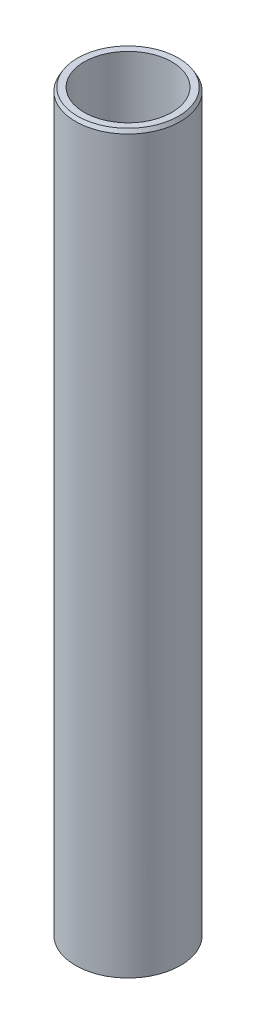
ISO-10303-21;
HEADER;
FILE_DESCRIPTION(('STEP AP214'),'2;1');
FILE_NAME('part.step','',(''),(''),'','','');
FILE_SCHEMA(('AUTOMOTIVE_DESIGN { 1 0 10303 214 1 1 1 1 }'));
ENDSEC;
DATA;
#1=APPLICATION_CONTEXT('core data for automotive mechanical design processes');
#2=APPLICATION_PROTOCOL_DEFINITION('international standard','automotive_design',2000,#1);
#3=PRODUCT_CONTEXT('',#1,'mechanical');
#4=PRODUCT('Part','Part','',(#3));
#5=PRODUCT_RELATED_PRODUCT_CATEGORY('part','',(#4));
#6=PRODUCT_DEFINITION_FORMATION('','',#4);
#7=PRODUCT_DEFINITION_CONTEXT('part definition',#1,'design');
#8=PRODUCT_DEFINITION('design','',#6,#7);
#9=PRODUCT_DEFINITION_SHAPE('','',#8);
#10=(LENGTH_UNIT() NAMED_UNIT(*) SI_UNIT(.MILLI.,.METRE.));
#11=(NAMED_UNIT(*) PLANE_ANGLE_UNIT() SI_UNIT($,.RADIAN.));
#12=(NAMED_UNIT(*) SI_UNIT($,.STERADIAN.) SOLID_ANGLE_UNIT());
#13=UNCERTAINTY_MEASURE_WITH_UNIT(LENGTH_MEASURE(1.E-05),#10,'distance_accuracy_value','');
#14=(GEOMETRIC_REPRESENTATION_CONTEXT(3) GLOBAL_UNCERTAINTY_ASSIGNED_CONTEXT((#13)) GLOBAL_UNIT_ASSIGNED_CONTEXT((#10,
#11,#12)) REPRESENTATION_CONTEXT('',''));
#15=CARTESIAN_POINT('',(0.,0.,0.));
#16=DIRECTION('',(0.,0.,1.));
#17=DIRECTION('',(1.,0.,0.));
#18=AXIS2_PLACEMENT_3D('',#15,#16,#17);
#19=CARTESIAN_POINT('',(0.,526.183527957873,0.));
#20=DIRECTION('',(0.,-1.,0.));
#21=DIRECTION('',(0.,0.,-1.));
#22=AXIS2_PLACEMENT_3D('',#19,#20,#21);
#23=CYLINDRICAL_SURFACE('',#22,37.5);
#24=CARTESIAN_POINT('',(0.,523.640362782101,0.));
#25=DIRECTION('',(0.,1.,0.));
#26=DIRECTION('',(0.,0.,1.));
#27=AXIS2_PLACEMENT_3D('',#24,#25,#26);
#28=CIRCLE('',#27,37.5);
#29=CARTESIAN_POINT('',(0.,523.640362782101,-37.5));
#30=VERTEX_POINT('',#29);
#31=EDGE_CURVE('E50',#30,#30,#28,.F.);
#32=CARTESIAN_POINT('',(0.,1.46829709882645,0.));
#33=DIRECTION('',(0.,1.,0.));
#34=DIRECTION('',(0.,0.,1.));
#35=AXIS2_PLACEMENT_3D('',#32,#33,#34);
#36=CIRCLE('',#35,37.5);
#37=CARTESIAN_POINT('',(0.,1.46829709882645,-37.5));
#38=VERTEX_POINT('',#37);
#39=EDGE_CURVE('E51',#38,#38,#36,.T.);
#40=CARTESIAN_POINT('',(0.,523.640362782101,-37.5));
#41=CARTESIAN_POINT('',(0.,518.201070431233,-37.5));
#42=CARTESIAN_POINT('',(0.,512.761778080366,-37.5));
#43=CARTESIAN_POINT('',(0.,501.883193378631,-37.5));
#44=CARTESIAN_POINT('',(0.,496.443901027763,-37.5));
#45=CARTESIAN_POINT('',(0.,485.565316326029,-37.5));
#46=CARTESIAN_POINT('',(0.,480.126023975161,-37.5));
#47=CARTESIAN_POINT('',(0.,469.247439273426,-37.5));
#48=CARTESIAN_POINT('',(0.,463.808146922559,-37.5));
#49=CARTESIAN_POINT('',(0.,452.929562220824,-37.5));
#50=CARTESIAN_POINT('',(0.,447.490269869956,-37.5));
#51=CARTESIAN_POINT('',(0.,436.611685168222,-37.5));
#52=CARTESIAN_POINT('',(0.,431.172392817354,-37.5));
#53=CARTESIAN_POINT('',(0.,420.293808115619,-37.5));
#54=CARTESIAN_POINT('',(0.,414.854515764752,-37.5));
#55=CARTESIAN_POINT('',(0.,403.975931063017,-37.5));
#56=CARTESIAN_POINT('',(0.,398.53663871215,-37.5));
#57=CARTESIAN_POINT('',(0.,387.658054010415,-37.5));
#58=CARTESIAN_POINT('',(0.,382.218761659547,-37.5));
#59=CARTESIAN_POINT('',(0.,371.340176957812,-37.5));
#60=CARTESIAN_POINT('',(0.,365.900884606945,-37.5));
#61=CARTESIAN_POINT('',(0.,355.02229990521,-37.5));
#62=CARTESIAN_POINT('',(0.,349.583007554343,-37.5));
#63=CARTESIAN_POINT('',(0.,338.704422852608,-37.5));
#64=CARTESIAN_POINT('',(0.,333.26513050174,-37.5));
#65=CARTESIAN_POINT('',(0.,322.386545800005,-37.5));
#66=CARTESIAN_POINT('',(0.,316.947253449138,-37.5));
#67=CARTESIAN_POINT('',(0.,306.068668747403,-37.5));
#68=CARTESIAN_POINT('',(0.,300.629376396536,-37.5));
#69=CARTESIAN_POINT('',(0.,289.750791694801,-37.5));
#70=CARTESIAN_POINT('',(0.,284.311499343933,-37.5));
#71=CARTESIAN_POINT('',(0.,273.432914642198,-37.5));
#72=CARTESIAN_POINT('',(0.,267.993622291331,-37.5));
#73=CARTESIAN_POINT('',(0.,257.115037589596,-37.5));
#74=CARTESIAN_POINT('',(0.,251.675745238729,-37.5));
#75=CARTESIAN_POINT('',(0.,240.797160536994,-37.5));
#76=CARTESIAN_POINT('',(0.,235.357868186126,-37.5));
#77=CARTESIAN_POINT('',(0.,224.479283484391,-37.5));
#78=CARTESIAN_POINT('',(0.,219.039991133524,-37.5));
#79=CARTESIAN_POINT('',(0.,208.161406431789,-37.5));
#80=CARTESIAN_POINT('',(0.,202.722114080922,-37.5));
#81=CARTESIAN_POINT('',(0.,191.843529379187,-37.5));
#82=CARTESIAN_POINT('',(0.,186.404237028319,-37.5));
#83=CARTESIAN_POINT('',(0.,175.525652326585,-37.5));
#84=CARTESIAN_POINT('',(0.,170.086359975717,-37.5));
#85=CARTESIAN_POINT('',(0.,159.207775273982,-37.5));
#86=CARTESIAN_POINT('',(0.,153.768482923115,-37.5));
#87=CARTESIAN_POINT('',(0.,142.88989822138,-37.5));
#88=CARTESIAN_POINT('',(0.,137.450605870512,-37.5));
#89=CARTESIAN_POINT('',(0.,126.572021168778,-37.5));
#90=CARTESIAN_POINT('',(0.,121.13272881791,-37.5));
#91=CARTESIAN_POINT('',(0.,110.254144116175,-37.5));
#92=CARTESIAN_POINT('',(0.,104.814851765308,-37.5));
#93=CARTESIAN_POINT('',(0.,93.9362670635729,-37.5));
#94=CARTESIAN_POINT('',(0.,88.4969747127055,-37.5));
#95=CARTESIAN_POINT('',(0.,77.6183900109706,-37.5));
#96=CARTESIAN_POINT('',(0.,72.1790976601032,-37.5));
#97=CARTESIAN_POINT('',(0.,61.3005129583683,-37.5));
#98=CARTESIAN_POINT('',(0.,55.8612206075008,-37.5));
#99=CARTESIAN_POINT('',(0.,44.982635905766,-37.5));
#100=CARTESIAN_POINT('',(0.,39.5433435548985,-37.5));
#101=CARTESIAN_POINT('',(0.,28.6647588531637,-37.5));
#102=CARTESIAN_POINT('',(0.,23.2254665022962,-37.5));
#103=CARTESIAN_POINT('',(0.,12.3468818005614,-37.5));
#104=CARTESIAN_POINT('',(0.,6.90758944969391,-37.5));
#105=CARTESIAN_POINT('',(0.,1.46829709882645,-37.5));
#106=B_SPLINE_CURVE_WITH_KNOTS('',3,(#40,#41,#42,#43,#44,#45,#46,#47,#48,#49,#50,#51,#52,#53,
#54,#55,#56,#57,#58,#59,#60,#61,#62,#63,#64,#65,#66,#67,#68,#69,#70,#71,#72,#73,#74,#75,#76,#77,
#78,#79,#80,#81,#82,#83,#84,#85,#86,#87,#88,#89,#90,#91,#92,#93,#94,#95,#96,#97,#98,#99,#100,
#101,#102,#103,#104,#105),.UNSPECIFIED.,.F.,.F.,(4,2,2,2,2,2,2,2,2,2,2,2,2,2,2,2,2,2,2,2,2,2,2,
2,2,2,2,2,2,2,2,2,4),(0.,16.3178770526022,32.6357541052046,48.9536311578069,65.2715082104092,
81.5893852630115,97.9072623156139,114.225139368216,130.543016420818,146.860893473421,
163.178770526023,179.496647578625,195.814524631228,212.13240168383,228.450278736432,
244.768155789035,261.086032841637,277.403909894239,293.721786946842,310.039663999444,
326.357541052046,342.675418104649,358.993295157251,375.311172209853,391.629049262456,
407.946926315058,424.26480336766,440.582680420262,456.900557472865,473.218434525467,
489.53631157807,505.854188630672,522.172065683274),.UNSPECIFIED.);
#107=EDGE_CURVE('BSEAM39',#30,#38,#106,.T.);
#108=ORIENTED_EDGE('',*,*,#31,.T.);
#109=ORIENTED_EDGE('',*,*,#39,.T.);
#110=ORIENTED_EDGE('',*,*,#107,.T.);
#111=ORIENTED_EDGE('',*,*,#107,.F.);
#112=EDGE_LOOP('',(#108,#110,#109,#111));
#113=FACE_BOUND('',#112,.T.);
#114=ADVANCED_FACE('F39',(#113),#23,.T.);
#115=CARTESIAN_POINT('',(0.,526.183527957873,0.));
#116=DIRECTION('',(0.,1.,0.));
#117=DIRECTION('',(0.,0.,1.));
#118=AXIS2_PLACEMENT_3D('',#115,#116,#117);
#119=PLANE('',#118);
#120=CARTESIAN_POINT('',(0.,526.183527957873,0.));
#121=DIRECTION('',(0.,1.,0.));
#122=DIRECTION('',(0.,0.,1.));
#123=AXIS2_PLACEMENT_3D('',#120,#121,#122);
#124=CIRCLE('',#123,36.031702901174);
#125=CARTESIAN_POINT('',(0.,526.183527957873,36.031702901174));
#126=VERTEX_POINT('',#125);
#127=EDGE_CURVE('E54',#126,#126,#124,.T.);
#128=ORIENTED_EDGE('',*,*,#127,.T.);
#129=EDGE_LOOP('',(#128));
#130=FACE_BOUND('',#129,.T.);
#131=CARTESIAN_POINT('',(0.,526.183527957873,0.));
#132=DIRECTION('',(0.,1.,0.));
#133=DIRECTION('',(0.,0.,1.));
#134=AXIS2_PLACEMENT_3D('',#131,#132,#133);
#135=CIRCLE('',#134,31.3051845331826);
#136=CARTESIAN_POINT('',(0.,526.183527957873,-31.3051845331826));
#137=VERTEX_POINT('',#136);
#138=EDGE_CURVE('E58',#137,#137,#135,.T.);
#139=ORIENTED_EDGE('',*,*,#138,.F.);
#140=EDGE_LOOP('',(#139));
#141=FACE_BOUND('',#140,.T.);
#142=ADVANCED_FACE('F69',(#130,#141),#119,.T.);
#143=CARTESIAN_POINT('',(0.,0.,0.));
#144=DIRECTION('',(0.,1.,0.));
#145=DIRECTION('',(0.,0.,1.));
#146=AXIS2_PLACEMENT_3D('',#143,#144,#145);
#147=PLANE('',#146);
#148=CARTESIAN_POINT('',(0.,0.,0.));
#149=DIRECTION('',(0.,1.,0.));
#150=DIRECTION('',(0.,0.,1.));
#151=AXIS2_PLACEMENT_3D('',#148,#149,#150);
#152=CIRCLE('',#151,34.9568348242266);
#153=CARTESIAN_POINT('',(0.,0.,34.9568348242266));
#154=VERTEX_POINT('',#153);
#155=EDGE_CURVE('E10',#154,#154,#152,.F.);
#156=ORIENTED_EDGE('',*,*,#155,.T.);
#157=EDGE_LOOP('',(#156));
#158=FACE_BOUND('',#157,.T.);
#159=CARTESIAN_POINT('',(0.,0.,0.));
#160=DIRECTION('',(0.,1.,0.));
#161=DIRECTION('',(0.,0.,1.));
#162=AXIS2_PLACEMENT_3D('',#159,#160,#161);
#163=CIRCLE('',#162,31.3051845331826);
#164=CARTESIAN_POINT('',(0.,0.,-31.3051845331826));
#165=VERTEX_POINT('',#164);
#166=EDGE_CURVE('E63',#165,#165,#163,.T.);
#167=ORIENTED_EDGE('',*,*,#166,.T.);
#168=EDGE_LOOP('',(#167));
#169=FACE_BOUND('',#168,.T.);
#170=ADVANCED_FACE('F75',(#158,#169),#147,.F.);
#171=CARTESIAN_POINT('',(0.,526.183527957873,0.));
#172=DIRECTION('',(0.,-1.,0.));
#173=DIRECTION('',(0.,0.,-1.));
#174=AXIS2_PLACEMENT_3D('',#171,#172,#173);
#175=CYLINDRICAL_SURFACE('',#174,31.3051845331826);
#176=CARTESIAN_POINT('',(0.,526.183527957873,-31.3051845331826));
#177=CARTESIAN_POINT('',(0.,520.702449541645,-31.3051845331826));
#178=CARTESIAN_POINT('',(0.,515.221371125418,-31.3051845331826));
#179=CARTESIAN_POINT('',(0.,504.259214292962,-31.3051845331826));
#180=CARTESIAN_POINT('',(0.,498.778135876734,-31.3051845331826));
#181=CARTESIAN_POINT('',(0.,487.815979044278,-31.3051845331826));
#182=CARTESIAN_POINT('',(0.,482.334900628051,-31.3051845331826));
#183=CARTESIAN_POINT('',(0.,471.372743795595,-31.3051845331826));
#184=CARTESIAN_POINT('',(0.,465.891665379367,-31.3051845331826));
#185=CARTESIAN_POINT('',(0.,454.929508546911,-31.3051845331826));
#186=CARTESIAN_POINT('',(0.,449.448430130683,-31.3051845331826));
#187=CARTESIAN_POINT('',(0.,438.486273298228,-31.3051845331826));
#188=CARTESIAN_POINT('',(0.,433.005194882,-31.3051845331826));
#189=CARTESIAN_POINT('',(0.,422.043038049544,-31.3051845331826));
#190=CARTESIAN_POINT('',(0.,416.561959633316,-31.3051845331826));
#191=CARTESIAN_POINT('',(0.,405.599802800861,-31.3051845331826));
#192=CARTESIAN_POINT('',(0.,400.118724384633,-31.3051845331826));
#193=CARTESIAN_POINT('',(0.,389.156567552177,-31.3051845331826));
#194=CARTESIAN_POINT('',(0.,383.675489135949,-31.3051845331826));
#195=CARTESIAN_POINT('',(0.,372.713332303494,-31.3051845331826));
#196=CARTESIAN_POINT('',(0.,367.232253887266,-31.3051845331826));
#197=CARTESIAN_POINT('',(0.,356.27009705481,-31.3051845331826));
#198=CARTESIAN_POINT('',(0.,350.789018638582,-31.3051845331826));
#199=CARTESIAN_POINT('',(0.,339.826861806126,-31.3051845331826));
#200=CARTESIAN_POINT('',(0.,334.345783389899,-31.3051845331826));
#201=CARTESIAN_POINT('',(0.,323.383626557443,-31.3051845331826));
#202=CARTESIAN_POINT('',(0.,317.902548141215,-31.3051845331826));
#203=CARTESIAN_POINT('',(0.,306.940391308759,-31.3051845331826));
#204=CARTESIAN_POINT('',(0.,301.459312892532,-31.3051845331826));
#205=CARTESIAN_POINT('',(0.,290.497156060076,-31.3051845331826));
#206=CARTESIAN_POINT('',(0.,285.016077643848,-31.3051845331826));
#207=CARTESIAN_POINT('',(0.,274.053920811392,-31.3051845331826));
#208=CARTESIAN_POINT('',(0.,268.572842395165,-31.3051845331826));
#209=CARTESIAN_POINT('',(0.,257.610685562709,-31.3051845331826));
#210=CARTESIAN_POINT('',(0.,252.129607146481,-31.3051845331826));
#211=CARTESIAN_POINT('',(0.,241.167450314025,-31.3051845331826));
#212=CARTESIAN_POINT('',(0.,235.686371897797,-31.3051845331826));
#213=CARTESIAN_POINT('',(0.,224.724215065342,-31.3051845331826));
#214=CARTESIAN_POINT('',(0.,219.243136649114,-31.3051845331826));
#215=CARTESIAN_POINT('',(0.,208.280979816658,-31.3051845331826));
#216=CARTESIAN_POINT('',(0.,202.79990140043,-31.3051845331826));
#217=CARTESIAN_POINT('',(0.,191.837744567975,-31.3051845331826));
#218=CARTESIAN_POINT('',(0.,186.356666151747,-31.3051845331826));
#219=CARTESIAN_POINT('',(0.,175.394509319291,-31.3051845331826));
#220=CARTESIAN_POINT('',(0.,169.913430903063,-31.3051845331826));
#221=CARTESIAN_POINT('',(0.,158.951274070608,-31.3051845331826));
#222=CARTESIAN_POINT('',(0.,153.47019565438,-31.3051845331826));
#223=CARTESIAN_POINT('',(0.,142.508038821924,-31.3051845331826));
#224=CARTESIAN_POINT('',(0.,137.026960405696,-31.3051845331826));
#225=CARTESIAN_POINT('',(0.,126.064803573241,-31.3051845331826));
#226=CARTESIAN_POINT('',(0.,120.583725157013,-31.3051845331826));
#227=CARTESIAN_POINT('',(0.,109.621568324557,-31.3051845331826));
#228=CARTESIAN_POINT('',(0.,104.140489908329,-31.3051845331826));
#229=CARTESIAN_POINT('',(0.,93.1783330758734,-31.3051845331826));
#230=CARTESIAN_POINT('',(0.,87.6972546596456,-31.3051845331826));
#231=CARTESIAN_POINT('',(0.,76.7350978271899,-31.3051845331826));
#232=CARTESIAN_POINT('',(0.,71.254019410962,-31.3051845331826));
#233=CARTESIAN_POINT('',(0.,60.2918625785063,-31.3051845331826));
#234=CARTESIAN_POINT('',(0.,54.8107841622785,-31.3051845331826));
#235=CARTESIAN_POINT('',(0.,43.8486273298228,-31.3051845331826));
#236=CARTESIAN_POINT('',(0.,38.3675489135949,-31.3051845331826));
#237=CARTESIAN_POINT('',(0.,27.4053920811392,-31.3051845331826));
#238=CARTESIAN_POINT('',(0.,21.9243136649114,-31.3051845331826));
#239=CARTESIAN_POINT('',(0.,10.9621568324557,-31.3051845331826));
#240=CARTESIAN_POINT('',(0.,5.48107841622784,-31.3051845331826));
#241=CARTESIAN_POINT('',(0.,0.,-31.3051845331826));
#242=B_SPLINE_CURVE_WITH_KNOTS('',3,(#176,#177,#178,#179,#180,#181,#182,#183,#184,#185,#186,
#187,#188,#189,#190,#191,#192,#193,#194,#195,#196,#197,#198,#199,#200,#201,#202,#203,#204,#205,
#206,#207,#208,#209,#210,#211,#212,#213,#214,#215,#216,#217,#218,#219,#220,#221,#222,#223,#224,
#225,#226,#227,#228,#229,#230,#231,#232,#233,#234,#235,#236,#237,#238,#239,#240,#241),
.UNSPECIFIED.,.F.,.F.,(4,2,2,2,2,2,2,2,2,2,2,2,2,2,2,2,2,2,2,2,2,2,2,2,2,2,2,2,2,2,2,2,4),(0.,
16.4432352486835,32.886470497367,49.3297057460506,65.7729409947341,82.2161762434176,
98.6594114921012,115.102646740785,131.545881989468,147.989117238152,164.432352486835,
180.875587735519,197.318822984202,213.762058232886,230.205293481569,246.648528730253,
263.091763978937,279.53499922762,295.978234476304,312.421469724987,328.864704973671,
345.307940222354,361.751175471038,378.194410719721,394.637645968405,411.080881217088,
427.524116465772,443.967351714456,460.410586963139,476.853822211823,493.297057460506,
509.74029270919,526.183527957873),.UNSPECIFIED.);
#243=EDGE_CURVE('BSEAM70',#137,#165,#242,.T.);
#244=ORIENTED_EDGE('',*,*,#138,.T.);
#245=ORIENTED_EDGE('',*,*,#166,.F.);
#246=ORIENTED_EDGE('',*,*,#243,.T.);
#247=ORIENTED_EDGE('',*,*,#243,.F.);
#248=EDGE_LOOP('',(#244,#246,#245,#247));
#249=FACE_BOUND('',#248,.T.);
#250=ADVANCED_FACE('F70',(#249),#175,.F.);
#251=CARTESIAN_POINT('',(0.,526.183527957873,0.));
#252=DIRECTION('',(0.,-1.,0.));
#253=DIRECTION('',(0.,0.,-1.));
#254=AXIS2_PLACEMENT_3D('',#251,#252,#253);
#255=CONICAL_SURFACE('',#254,36.031702901174,0.523598775598297);
#256=ORIENTED_EDGE('',*,*,#31,.F.);
#257=EDGE_LOOP('',(#256));
#258=FACE_BOUND('',#257,.T.);
#259=ORIENTED_EDGE('',*,*,#127,.F.);
#260=EDGE_LOOP('',(#259));
#261=FACE_BOUND('',#260,.T.);
#262=ADVANCED_FACE('F81',(#258,#261),#255,.T.);
#263=CARTESIAN_POINT('',(0.,1.46829709882645,0.));
#264=DIRECTION('',(0.,1.,0.));
#265=DIRECTION('',(0.,0.,1.));
#266=AXIS2_PLACEMENT_3D('',#263,#264,#265);
#267=CONICAL_SURFACE('',#266,37.5,1.0471975511966);
#268=ORIENTED_EDGE('',*,*,#155,.F.);
#269=EDGE_LOOP('',(#268));
#270=FACE_BOUND('',#269,.T.);
#271=ORIENTED_EDGE('',*,*,#39,.F.);
#272=EDGE_LOOP('',(#271));
#273=FACE_BOUND('',#272,.T.);
#274=ADVANCED_FACE('F45',(#270,#273),#267,.T.);
#275=CLOSED_SHELL('',(#114,#142,#170,#250,#262,#274));
#276=MANIFOLD_SOLID_BREP('B2',#275);
#277=ADVANCED_BREP_SHAPE_REPRESENTATION('',(#18,#276),#14);
#278=SHAPE_DEFINITION_REPRESENTATION(#9,#277);
ENDSEC;
END-ISO-10303-21;
